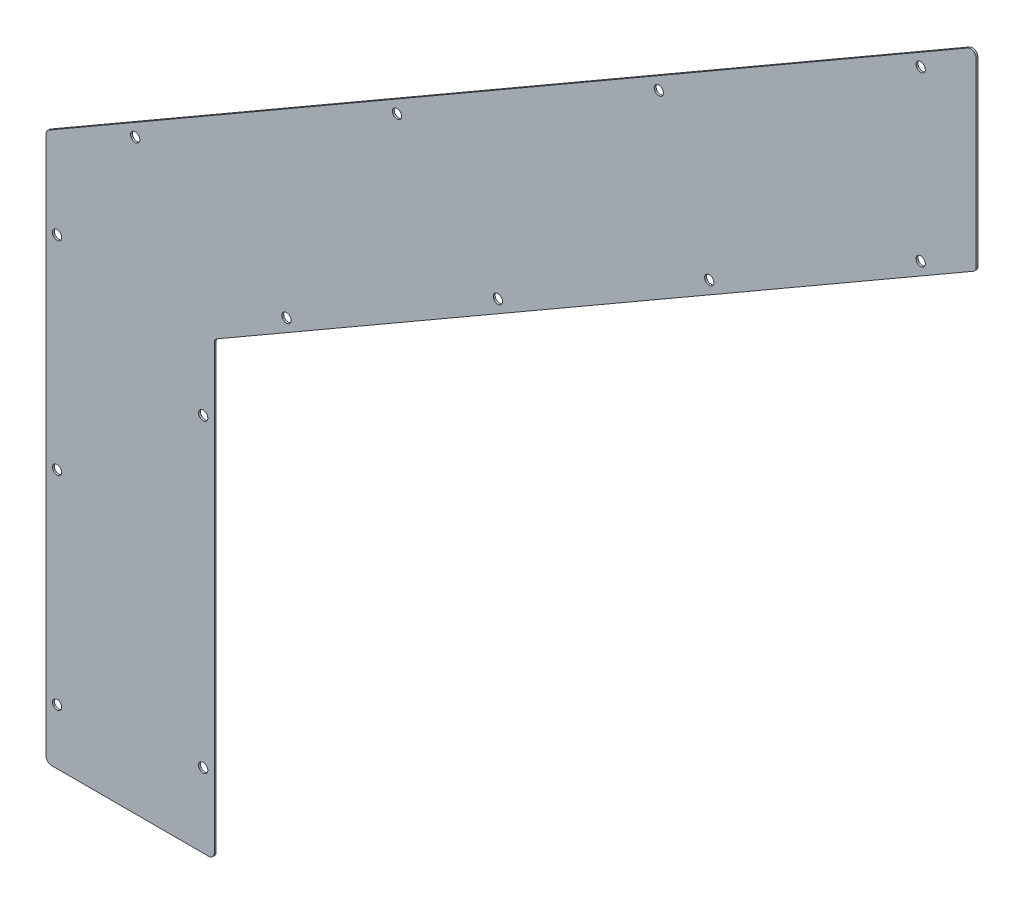
ISO-10303-21;
HEADER;
FILE_DESCRIPTION(('STEP AP214'),'2;1');
FILE_NAME('part.step','',(''),(''),'','','');
FILE_SCHEMA(('AUTOMOTIVE_DESIGN { 1 0 10303 214 1 1 1 1 }'));
ENDSEC;
DATA;
#1=APPLICATION_CONTEXT('core data for automotive mechanical design processes');
#2=APPLICATION_PROTOCOL_DEFINITION('international standard','automotive_design',2000,#1);
#3=PRODUCT_CONTEXT('',#1,'mechanical');
#4=PRODUCT('Part','Part','',(#3));
#5=PRODUCT_RELATED_PRODUCT_CATEGORY('part','',(#4));
#6=PRODUCT_DEFINITION_FORMATION('','',#4);
#7=PRODUCT_DEFINITION_CONTEXT('part definition',#1,'design');
#8=PRODUCT_DEFINITION('design','',#6,#7);
#9=PRODUCT_DEFINITION_SHAPE('','',#8);
#10=(LENGTH_UNIT() NAMED_UNIT(*) SI_UNIT(.MILLI.,.METRE.));
#11=(NAMED_UNIT(*) PLANE_ANGLE_UNIT() SI_UNIT($,.RADIAN.));
#12=(NAMED_UNIT(*) SI_UNIT($,.STERADIAN.) SOLID_ANGLE_UNIT());
#13=UNCERTAINTY_MEASURE_WITH_UNIT(LENGTH_MEASURE(1.E-05),#10,'distance_accuracy_value','');
#14=(GEOMETRIC_REPRESENTATION_CONTEXT(3) GLOBAL_UNCERTAINTY_ASSIGNED_CONTEXT((#13)) GLOBAL_UNIT_ASSIGNED_CONTEXT((#10,
#11,#12)) REPRESENTATION_CONTEXT('',''));
#15=CARTESIAN_POINT('',(0.,0.,0.));
#16=DIRECTION('',(0.,0.,1.));
#17=DIRECTION('',(1.,0.,0.));
#18=AXIS2_PLACEMENT_3D('',#15,#16,#17);
#19=CARTESIAN_POINT('',(-91.,0.,-1.));
#20=DIRECTION('',(0.,-1.,0.));
#21=DIRECTION('',(0.,0.,-1.));
#22=AXIS2_PLACEMENT_3D('',#19,#20,#21);
#23=PLANE('',#22);
#24=DIRECTION('',(1.,0.,0.));
#25=VECTOR('',#24,1.);
#26=CARTESIAN_POINT('',(-91.,0.,0.));
#27=LINE('',#26,#25);
#28=CARTESIAN_POINT('',(-88.,0.,0.));
#29=VERTEX_POINT('',#28);
#30=CARTESIAN_POINT('',(-3.,0.,0.));
#31=VERTEX_POINT('',#30);
#32=EDGE_CURVE('E241',#29,#31,#27,.T.);
#33=ORIENTED_EDGE('',*,*,#32,.F.);
#34=DIRECTION('',(0.,0.,1.));
#35=VECTOR('',#34,1.);
#36=CARTESIAN_POINT('',(-88.,0.,-1.));
#37=LINE('',#36,#35);
#38=CARTESIAN_POINT('',(-88.,0.,-1.));
#39=VERTEX_POINT('',#38);
#40=EDGE_CURVE('E187',#29,#39,#37,.F.);
#41=ORIENTED_EDGE('',*,*,#40,.T.);
#42=DIRECTION('',(1.,0.,0.));
#43=VECTOR('',#42,1.);
#44=CARTESIAN_POINT('',(-91.,0.,-1.));
#45=LINE('',#44,#43);
#46=CARTESIAN_POINT('',(-3.,0.,-1.));
#47=VERTEX_POINT('',#46);
#48=EDGE_CURVE('E274',#39,#47,#45,.T.);
#49=ORIENTED_EDGE('',*,*,#48,.T.);
#50=DIRECTION('',(0.,0.,1.));
#51=VECTOR('',#50,1.);
#52=CARTESIAN_POINT('',(-3.,0.,-1.));
#53=LINE('',#52,#51);
#54=EDGE_CURVE('E184',#47,#31,#53,.T.);
#55=ORIENTED_EDGE('',*,*,#54,.T.);
#56=EDGE_LOOP('',(#33,#41,#49,#55));
#57=FACE_BOUND('',#56,.T.);
#58=ADVANCED_FACE('F40',(#57),#23,.T.);
#59=CARTESIAN_POINT('',(-91.,296.01,-1.));
#60=DIRECTION('',(-1.,0.,0.));
#61=DIRECTION('',(0.,-1.,0.));
#62=AXIS2_PLACEMENT_3D('',#59,#60,#61);
#63=PLANE('',#62);
#64=DIRECTION('',(0.,-1.,0.));
#65=VECTOR('',#64,1.);
#66=CARTESIAN_POINT('',(-91.,296.01,0.));
#67=LINE('',#66,#65);
#68=CARTESIAN_POINT('',(-91.,294.277949192431,0.));
#69=VERTEX_POINT('',#68);
#70=CARTESIAN_POINT('',(-91.,3.,0.));
#71=VERTEX_POINT('',#70);
#72=EDGE_CURVE('E151',#69,#71,#67,.T.);
#73=ORIENTED_EDGE('',*,*,#72,.F.);
#74=DIRECTION('',(0.,0.,1.));
#75=VECTOR('',#74,1.);
#76=CARTESIAN_POINT('',(-91.,294.277949192431,-1.));
#77=LINE('',#76,#75);
#78=CARTESIAN_POINT('',(-91.,294.277949192431,-1.));
#79=VERTEX_POINT('',#78);
#80=EDGE_CURVE('E173',#69,#79,#77,.F.);
#81=ORIENTED_EDGE('',*,*,#80,.T.);
#82=DIRECTION('',(0.,-1.,0.));
#83=VECTOR('',#82,1.);
#84=CARTESIAN_POINT('',(-91.,296.01,-1.));
#85=LINE('',#84,#83);
#86=CARTESIAN_POINT('',(-91.,3.,-1.));
#87=VERTEX_POINT('',#86);
#88=EDGE_CURVE('E155',#79,#87,#85,.T.);
#89=ORIENTED_EDGE('',*,*,#88,.T.);
#90=DIRECTION('',(0.,0.,1.));
#91=VECTOR('',#90,1.);
#92=CARTESIAN_POINT('',(-91.,3.,-1.));
#93=LINE('',#92,#91);
#94=EDGE_CURVE('E170',#87,#71,#93,.T.);
#95=ORIENTED_EDGE('',*,*,#94,.T.);
#96=EDGE_LOOP('',(#73,#81,#89,#95));
#97=FACE_BOUND('',#96,.T.);
#98=ADVANCED_FACE('F293',(#97),#63,.T.);
#99=CARTESIAN_POINT('',(412.,586.41718540238,-1.));
#100=DIRECTION('',(-0.499999999999998,0.86602540378444,0.));
#101=DIRECTION('',(-0.86602540378444,-0.499999999999998,0.));
#102=AXIS2_PLACEMENT_3D('',#99,#100,#101);
#103=PLANE('',#102);
#104=DIRECTION('',(-0.86602540378444,-0.499999999999998,0.));
#105=VECTOR('',#104,1.);
#106=CARTESIAN_POINT('',(412.,586.41718540238,-1.));
#107=LINE('',#106,#105);
#108=CARTESIAN_POINT('',(407.5,583.819109191027,-1.));
#109=VERTEX_POINT('',#108);
#110=CARTESIAN_POINT('',(-89.4999999999999,296.876025403784,-1.));
#111=VERTEX_POINT('',#110);
#112=EDGE_CURVE('E159',#109,#111,#107,.T.);
#113=ORIENTED_EDGE('',*,*,#112,.T.);
#114=DIRECTION('',(0.,0.,1.));
#115=VECTOR('',#114,1.);
#116=CARTESIAN_POINT('',(-89.5,296.876025403784,-1.));
#117=LINE('',#116,#115);
#118=CARTESIAN_POINT('',(-89.4999999999999,296.876025403784,0.));
#119=VERTEX_POINT('',#118);
#120=EDGE_CURVE('E142',#111,#119,#117,.T.);
#121=ORIENTED_EDGE('',*,*,#120,.T.);
#122=DIRECTION('',(-0.86602540378444,-0.499999999999998,0.));
#123=VECTOR('',#122,1.);
#124=CARTESIAN_POINT('',(412.,586.41718540238,0.));
#125=LINE('',#124,#123);
#126=CARTESIAN_POINT('',(407.5,583.819109191027,0.));
#127=VERTEX_POINT('',#126);
#128=EDGE_CURVE('E134',#127,#119,#125,.T.);
#129=ORIENTED_EDGE('',*,*,#128,.F.);
#130=DIRECTION('',(0.,0.,1.));
#131=VECTOR('',#130,1.);
#132=CARTESIAN_POINT('',(407.5,583.819109191027,-1.));
#133=LINE('',#132,#131);
#134=EDGE_CURVE('E148',#127,#109,#133,.F.);
#135=ORIENTED_EDGE('',*,*,#134,.T.);
#136=EDGE_LOOP('',(#113,#121,#129,#135));
#137=FACE_BOUND('',#136,.T.);
#138=ADVANCED_FACE('F147',(#137),#103,.T.);
#139=CARTESIAN_POINT('',(412.,481.605017533696,-1.));
#140=DIRECTION('',(1.,0.,0.));
#141=DIRECTION('',(0.,0.,-1.));
#142=AXIS2_PLACEMENT_3D('',#139,#140,#141);
#143=PLANE('',#142);
#144=DIRECTION('',(0.,1.,0.));
#145=VECTOR('',#144,1.);
#146=CARTESIAN_POINT('',(412.,481.605017533696,0.));
#147=LINE('',#146,#145);
#148=CARTESIAN_POINT('',(412.,483.337068341265,0.));
#149=VERTEX_POINT('',#148);
#150=CARTESIAN_POINT('',(412.,581.221032979674,0.));
#151=VERTEX_POINT('',#150);
#152=EDGE_CURVE('E136',#149,#151,#147,.T.);
#153=ORIENTED_EDGE('',*,*,#152,.F.);
#154=DIRECTION('',(0.,0.,1.));
#155=VECTOR('',#154,1.);
#156=CARTESIAN_POINT('',(412.,483.337068341265,-1.));
#157=LINE('',#156,#155);
#158=CARTESIAN_POINT('',(412.,483.337068341265,-1.));
#159=VERTEX_POINT('',#158);
#160=EDGE_CURVE('E200',#149,#159,#157,.F.);
#161=ORIENTED_EDGE('',*,*,#160,.T.);
#162=DIRECTION('',(0.,1.,0.));
#163=VECTOR('',#162,1.);
#164=CARTESIAN_POINT('',(412.,481.605017533696,-1.));
#165=LINE('',#164,#163);
#166=CARTESIAN_POINT('',(412.,581.221032979674,-1.));
#167=VERTEX_POINT('',#166);
#168=EDGE_CURVE('E285',#159,#167,#165,.T.);
#169=ORIENTED_EDGE('',*,*,#168,.T.);
#170=DIRECTION('',(0.,0.,1.));
#171=VECTOR('',#170,1.);
#172=CARTESIAN_POINT('',(412.,581.221032979674,-1.));
#173=LINE('',#172,#171);
#174=EDGE_CURVE('E198',#167,#151,#173,.T.);
#175=ORIENTED_EDGE('',*,*,#174,.T.);
#176=EDGE_LOOP('',(#153,#161,#169,#175));
#177=FACE_BOUND('',#176,.T.);
#178=ADVANCED_FACE('F338',(#177),#143,.T.);
#179=CARTESIAN_POINT('',(0.,243.736706627571,-1.));
#180=DIRECTION('',(0.499999999999998,-0.86602540378444,0.));
#181=DIRECTION('',(0.86602540378444,0.499999999999998,0.));
#182=AXIS2_PLACEMENT_3D('',#179,#180,#181);
#183=PLANE('',#182);
#184=DIRECTION('',(0.86602540378444,0.499999999999998,0.));
#185=VECTOR('',#184,1.);
#186=CARTESIAN_POINT('',(0.,243.736706627571,0.));
#187=LINE('',#186,#185);
#188=CARTESIAN_POINT('',(1.50000000000001,244.602732031356,0.));
#189=VERTEX_POINT('',#188);
#190=CARTESIAN_POINT('',(410.5,480.738992129911,0.));
#191=VERTEX_POINT('',#190);
#192=EDGE_CURVE('E249',#189,#191,#187,.T.);
#193=ORIENTED_EDGE('',*,*,#192,.F.);
#194=DIRECTION('',(0.,0.,1.));
#195=VECTOR('',#194,1.);
#196=CARTESIAN_POINT('',(1.50000000000001,244.602732031356,-1.));
#197=LINE('',#196,#195);
#198=CARTESIAN_POINT('',(1.50000000000001,244.602732031356,-1.));
#199=VERTEX_POINT('',#198);
#200=EDGE_CURVE('E196',#189,#199,#197,.F.);
#201=ORIENTED_EDGE('',*,*,#200,.T.);
#202=DIRECTION('',(0.86602540378444,0.499999999999998,0.));
#203=VECTOR('',#202,1.);
#204=CARTESIAN_POINT('',(0.,243.736706627571,-1.));
#205=LINE('',#204,#203);
#206=CARTESIAN_POINT('',(410.5,480.738992129911,-1.));
#207=VERTEX_POINT('',#206);
#208=EDGE_CURVE('E277',#199,#207,#205,.T.);
#209=ORIENTED_EDGE('',*,*,#208,.T.);
#210=DIRECTION('',(0.,0.,1.));
#211=VECTOR('',#210,1.);
#212=CARTESIAN_POINT('',(410.5,480.738992129911,-1.));
#213=LINE('',#212,#211);
#214=EDGE_CURVE('E193',#207,#191,#213,.T.);
#215=ORIENTED_EDGE('',*,*,#214,.T.);
#216=EDGE_LOOP('',(#193,#201,#209,#215));
#217=FACE_BOUND('',#216,.T.);
#218=ADVANCED_FACE('F258',(#217),#183,.T.);
#219=CARTESIAN_POINT('',(0.,0.,-1.));
#220=DIRECTION('',(1.,0.,0.));
#221=DIRECTION('',(0.,0.,-1.));
#222=AXIS2_PLACEMENT_3D('',#219,#220,#221);
#223=PLANE('',#222);
#224=DIRECTION('',(0.,1.,0.));
#225=VECTOR('',#224,1.);
#226=CARTESIAN_POINT('',(0.,0.,0.));
#227=LINE('',#226,#225);
#228=CARTESIAN_POINT('',(0.,3.,0.));
#229=VERTEX_POINT('',#228);
#230=CARTESIAN_POINT('',(0.,242.004655820002,0.));
#231=VERTEX_POINT('',#230);
#232=EDGE_CURVE('E245',#229,#231,#227,.T.);
#233=ORIENTED_EDGE('',*,*,#232,.F.);
#234=DIRECTION('',(0.,0.,1.));
#235=VECTOR('',#234,1.);
#236=CARTESIAN_POINT('',(0.,3.,-1.));
#237=LINE('',#236,#235);
#238=CARTESIAN_POINT('',(0.,3.,-1.));
#239=VERTEX_POINT('',#238);
#240=EDGE_CURVE('E62',#229,#239,#237,.F.);
#241=ORIENTED_EDGE('',*,*,#240,.T.);
#242=DIRECTION('',(0.,1.,0.));
#243=VECTOR('',#242,1.);
#244=CARTESIAN_POINT('',(0.,0.,-1.));
#245=LINE('',#244,#243);
#246=CARTESIAN_POINT('',(0.,242.004655820002,-1.));
#247=VERTEX_POINT('',#246);
#248=EDGE_CURVE('E265',#239,#247,#245,.T.);
#249=ORIENTED_EDGE('',*,*,#248,.T.);
#250=DIRECTION('',(0.,0.,1.));
#251=VECTOR('',#250,1.);
#252=CARTESIAN_POINT('',(0.,242.004655820002,0.));
#253=LINE('',#252,#251);
#254=EDGE_CURVE('E189',#247,#231,#253,.T.);
#255=ORIENTED_EDGE('',*,*,#254,.T.);
#256=EDGE_LOOP('',(#233,#241,#249,#255));
#257=FACE_BOUND('',#256,.T.);
#258=ADVANCED_FACE('F264',(#257),#223,.T.);
#259=CARTESIAN_POINT('',(0.,0.,-1.));
#260=DIRECTION('',(0.,0.,1.));
#261=DIRECTION('',(1.,0.,0.));
#262=AXIS2_PLACEMENT_3D('',#259,#260,#261);
#263=PLANE('',#262);
#264=CARTESIAN_POINT('',(382.,562.168474096416,-1.));
#265=DIRECTION('',(0.,0.,-1.));
#266=DIRECTION('',(-1.,0.,0.));
#267=AXIS2_PLACEMENT_3D('',#264,#265,#266);
#268=CIRCLE('',#267,2.50000000000002);
#269=CARTESIAN_POINT('',(379.5,562.168474096416,-1.));
#270=VERTEX_POINT('',#269);
#271=EDGE_CURVE('E207',#270,#270,#268,.T.);
#272=ORIENTED_EDGE('',*,*,#271,.F.);
#273=EDGE_LOOP('',(#272));
#274=FACE_BOUND('',#273,.T.);
#275=CARTESIAN_POINT('',(-6.00000000000001,205.,-1.));
#276=DIRECTION('',(0.,0.,-1.));
#277=DIRECTION('',(-1.,0.,0.));
#278=AXIS2_PLACEMENT_3D('',#275,#276,#277);
#279=CIRCLE('',#278,2.5);
#280=CARTESIAN_POINT('',(-8.50000000000001,205.,-1.));
#281=VERTEX_POINT('',#280);
#282=EDGE_CURVE('E608',#281,#281,#279,.T.);
#283=ORIENTED_EDGE('',*,*,#282,.F.);
#284=EDGE_LOOP('',(#283));
#285=FACE_BOUND('',#284,.T.);
#286=CARTESIAN_POINT('',(-84.9999999999992,250.,-1.));
#287=DIRECTION('',(0.,0.,-1.));
#288=DIRECTION('',(-1.,0.,0.));
#289=AXIS2_PLACEMENT_3D('',#286,#287,#288);
#290=CIRCLE('',#289,2.50000000000001);
#291=CARTESIAN_POINT('',(-87.4999999999992,250.,-1.));
#292=VERTEX_POINT('',#291);
#293=EDGE_CURVE('E605',#292,#292,#290,.T.);
#294=ORIENTED_EDGE('',*,*,#293,.F.);
#295=EDGE_LOOP('',(#294));
#296=FACE_BOUND('',#295,.T.);
#297=CARTESIAN_POINT('',(-84.9999999999996,140.,-1.));
#298=DIRECTION('',(0.,0.,-1.));
#299=DIRECTION('',(-1.,0.,0.));
#300=AXIS2_PLACEMENT_3D('',#297,#298,#299);
#301=CIRCLE('',#300,2.5);
#302=CARTESIAN_POINT('',(-87.4999999999996,140.,-1.));
#303=VERTEX_POINT('',#302);
#304=EDGE_CURVE('E602',#303,#303,#301,.T.);
#305=ORIENTED_EDGE('',*,*,#304,.F.);
#306=EDGE_LOOP('',(#305));
#307=FACE_BOUND('',#306,.T.);
#308=CARTESIAN_POINT('',(-6.00000000000001,40.,-1.));
#309=DIRECTION('',(0.,0.,-1.));
#310=DIRECTION('',(-1.,0.,0.));
#311=AXIS2_PLACEMENT_3D('',#308,#309,#310);
#312=CIRCLE('',#311,2.5);
#313=CARTESIAN_POINT('',(-8.50000000000001,40.,-1.));
#314=VERTEX_POINT('',#313);
#315=EDGE_CURVE('E598',#314,#314,#312,.T.);
#316=ORIENTED_EDGE('',*,*,#315,.F.);
#317=EDGE_LOOP('',(#316));
#318=FACE_BOUND('',#317,.T.);
#319=CARTESIAN_POINT('',(382.,471.212712688284,-1.));
#320=DIRECTION('',(0.,0.,-1.));
#321=DIRECTION('',(-1.,0.,0.));
#322=AXIS2_PLACEMENT_3D('',#319,#320,#321);
#323=CIRCLE('',#322,2.50000000000002);
#324=CARTESIAN_POINT('',(379.5,471.212712688284,-1.));
#325=VERTEX_POINT('',#324);
#326=EDGE_CURVE('E592',#325,#325,#323,.T.);
#327=ORIENTED_EDGE('',*,*,#326,.F.);
#328=EDGE_LOOP('',(#327));
#329=FACE_BOUND('',#328,.T.);
#330=CARTESIAN_POINT('',(240.404846481244,480.418474096416,-1.));
#331=DIRECTION('',(0.,0.,-1.));
#332=DIRECTION('',(-1.,0.,0.));
#333=AXIS2_PLACEMENT_3D('',#330,#331,#332);
#334=CIRCLE('',#333,2.5);
#335=CARTESIAN_POINT('',(237.904846481244,480.418474096416,-1.));
#336=VERTEX_POINT('',#335);
#337=EDGE_CURVE('E595',#336,#336,#334,.T.);
#338=ORIENTED_EDGE('',*,*,#337,.F.);
#339=EDGE_LOOP('',(#338));
#340=FACE_BOUND('',#339,.T.);
#341=CARTESIAN_POINT('',(98.8096929624882,398.668474096417,-1.));
#342=DIRECTION('',(0.,0.,-1.));
#343=DIRECTION('',(-1.,0.,0.));
#344=AXIS2_PLACEMENT_3D('',#341,#342,#343);
#345=CIRCLE('',#344,2.5);
#346=CARTESIAN_POINT('',(96.3096929624882,398.668474096417,-1.));
#347=VERTEX_POINT('',#346);
#348=EDGE_CURVE('E623',#347,#347,#345,.T.);
#349=ORIENTED_EDGE('',*,*,#348,.F.);
#350=EDGE_LOOP('',(#349));
#351=FACE_BOUND('',#350,.T.);
#352=CARTESIAN_POINT('',(-42.7854605562677,316.918474096417,-1.));
#353=DIRECTION('',(0.,0.,-1.));
#354=DIRECTION('',(-1.,0.,0.));
#355=AXIS2_PLACEMENT_3D('',#352,#353,#354);
#356=CIRCLE('',#355,2.5);
#357=CARTESIAN_POINT('',(-45.2854605562677,316.918474096417,-1.));
#358=VERTEX_POINT('',#357);
#359=EDGE_CURVE('E281',#358,#358,#356,.T.);
#360=ORIENTED_EDGE('',*,*,#359,.F.);
#361=EDGE_LOOP('',(#360));
#362=FACE_BOUND('',#361,.T.);
#363=CARTESIAN_POINT('',(39.0539401013619,273.212712688285,-1.));
#364=DIRECTION('',(0.,0.,-1.));
#365=DIRECTION('',(-1.,0.,0.));
#366=AXIS2_PLACEMENT_3D('',#363,#364,#365);
#367=CIRCLE('',#366,2.5);
#368=CARTESIAN_POINT('',(36.5539401013619,273.212712688285,-1.));
#369=VERTEX_POINT('',#368);
#370=EDGE_CURVE('E601',#369,#369,#367,.T.);
#371=ORIENTED_EDGE('',*,*,#370,.F.);
#372=EDGE_LOOP('',(#371));
#373=FACE_BOUND('',#372,.T.);
#374=CARTESIAN_POINT('',(153.369293400908,339.212712688284,-1.));
#375=DIRECTION('',(0.,0.,-1.));
#376=DIRECTION('',(-1.,0.,0.));
#377=AXIS2_PLACEMENT_3D('',#374,#375,#376);
#378=CIRCLE('',#377,2.5);
#379=CARTESIAN_POINT('',(150.869293400908,339.212712688284,-1.));
#380=VERTEX_POINT('',#379);
#381=EDGE_CURVE('E611',#380,#380,#378,.T.);
#382=ORIENTED_EDGE('',*,*,#381,.F.);
#383=EDGE_LOOP('',(#382));
#384=FACE_BOUND('',#383,.T.);
#385=CARTESIAN_POINT('',(267.684646700454,405.212712688284,-1.));
#386=DIRECTION('',(0.,0.,-1.));
#387=DIRECTION('',(-1.,0.,0.));
#388=AXIS2_PLACEMENT_3D('',#385,#386,#387);
#389=CIRCLE('',#388,2.50000000000002);
#390=CARTESIAN_POINT('',(265.184646700454,405.212712688284,-1.));
#391=VERTEX_POINT('',#390);
#392=EDGE_CURVE('E614',#391,#391,#389,.T.);
#393=ORIENTED_EDGE('',*,*,#392,.F.);
#394=EDGE_LOOP('',(#393));
#395=FACE_BOUND('',#394,.T.);
#396=CARTESIAN_POINT('',(-85.,30.,-1.));
#397=DIRECTION('',(0.,0.,-1.));
#398=DIRECTION('',(-1.,0.,0.));
#399=AXIS2_PLACEMENT_3D('',#396,#397,#398);
#400=CIRCLE('',#399,2.5);
#401=CARTESIAN_POINT('',(-87.5,30.,-1.));
#402=VERTEX_POINT('',#401);
#403=EDGE_CURVE('E617',#402,#402,#400,.T.);
#404=ORIENTED_EDGE('',*,*,#403,.F.);
#405=EDGE_LOOP('',(#404));
#406=FACE_BOUND('',#405,.T.);
#407=ORIENTED_EDGE('',*,*,#88,.F.);
#408=CARTESIAN_POINT('',(-88.,294.277949192431,-1.));
#409=DIRECTION('',(0.,0.,1.));
#410=DIRECTION('',(1.,0.,0.));
#411=AXIS2_PLACEMENT_3D('',#408,#409,#410);
#412=CIRCLE('',#411,3.);
#413=EDGE_CURVE('E182',#79,#111,#412,.F.);
#414=ORIENTED_EDGE('',*,*,#413,.T.);
#415=ORIENTED_EDGE('',*,*,#112,.F.);
#416=CARTESIAN_POINT('',(409.,581.221032979674,-1.));
#417=DIRECTION('',(0.,0.,1.));
#418=DIRECTION('',(1.,0.,0.));
#419=AXIS2_PLACEMENT_3D('',#416,#417,#418);
#420=CIRCLE('',#419,3.);
#421=EDGE_CURVE('E154',#109,#167,#420,.F.);
#422=ORIENTED_EDGE('',*,*,#421,.T.);
#423=ORIENTED_EDGE('',*,*,#168,.F.);
#424=CARTESIAN_POINT('',(409.,483.337068341265,-1.));
#425=DIRECTION('',(0.,0.,1.));
#426=DIRECTION('',(1.,0.,0.));
#427=AXIS2_PLACEMENT_3D('',#424,#425,#426);
#428=CIRCLE('',#427,3.);
#429=EDGE_CURVE('E176',#159,#207,#428,.F.);
#430=ORIENTED_EDGE('',*,*,#429,.T.);
#431=ORIENTED_EDGE('',*,*,#208,.F.);
#432=CARTESIAN_POINT('',(3.,242.004655820002,-1.));
#433=DIRECTION('',(0.,0.,1.));
#434=DIRECTION('',(1.,0.,0.));
#435=AXIS2_PLACEMENT_3D('',#432,#433,#434);
#436=CIRCLE('',#435,3.);
#437=EDGE_CURVE('E11',#199,#247,#436,.T.);
#438=ORIENTED_EDGE('',*,*,#437,.T.);
#439=ORIENTED_EDGE('',*,*,#248,.F.);
#440=CARTESIAN_POINT('',(-3.,3.,-1.));
#441=DIRECTION('',(0.,0.,1.));
#442=DIRECTION('',(1.,0.,0.));
#443=AXIS2_PLACEMENT_3D('',#440,#441,#442);
#444=CIRCLE('',#443,3.);
#445=EDGE_CURVE('E178',#239,#47,#444,.F.);
#446=ORIENTED_EDGE('',*,*,#445,.T.);
#447=ORIENTED_EDGE('',*,*,#48,.F.);
#448=CARTESIAN_POINT('',(-88.,3.,-1.));
#449=DIRECTION('',(0.,0.,1.));
#450=DIRECTION('',(1.,0.,0.));
#451=AXIS2_PLACEMENT_3D('',#448,#449,#450);
#452=CIRCLE('',#451,3.);
#453=EDGE_CURVE('E180',#39,#87,#452,.F.);
#454=ORIENTED_EDGE('',*,*,#453,.T.);
#455=EDGE_LOOP('',(#407,#414,#415,#422,#423,#430,#431,#438,#439,#446,#447,#454));
#456=FACE_BOUND('',#455,.T.);
#457=ADVANCED_FACE('F298',(#274,#285,#296,#307,#318,#329,#340,#351,#362,#373,#384,#395,#406,
#456),#263,.F.);
#458=CARTESIAN_POINT('',(0.,0.,0.));
#459=DIRECTION('',(0.,0.,1.));
#460=DIRECTION('',(1.,0.,0.));
#461=AXIS2_PLACEMENT_3D('',#458,#459,#460);
#462=PLANE('',#461);
#463=CARTESIAN_POINT('',(382.,562.168474096416,0.));
#464=DIRECTION('',(0.,0.,1.));
#465=DIRECTION('',(1.,0.,0.));
#466=AXIS2_PLACEMENT_3D('',#463,#464,#465);
#467=CIRCLE('',#466,2.50000000000002);
#468=CARTESIAN_POINT('',(384.5,562.168474096416,0.));
#469=VERTEX_POINT('',#468);
#470=EDGE_CURVE('E44',#469,#469,#467,.T.);
#471=ORIENTED_EDGE('',*,*,#470,.F.);
#472=EDGE_LOOP('',(#471));
#473=FACE_BOUND('',#472,.T.);
#474=CARTESIAN_POINT('',(-6.00000000000001,205.,0.));
#475=DIRECTION('',(0.,0.,1.));
#476=DIRECTION('',(1.,0.,0.));
#477=AXIS2_PLACEMENT_3D('',#474,#475,#476);
#478=CIRCLE('',#477,2.5);
#479=CARTESIAN_POINT('',(-3.5,205.,0.));
#480=VERTEX_POINT('',#479);
#481=EDGE_CURVE('E236',#480,#480,#478,.T.);
#482=ORIENTED_EDGE('',*,*,#481,.F.);
#483=EDGE_LOOP('',(#482));
#484=FACE_BOUND('',#483,.T.);
#485=CARTESIAN_POINT('',(-84.9999999999992,250.,0.));
#486=DIRECTION('',(0.,0.,1.));
#487=DIRECTION('',(1.,0.,0.));
#488=AXIS2_PLACEMENT_3D('',#485,#486,#487);
#489=CIRCLE('',#488,2.50000000000001);
#490=CARTESIAN_POINT('',(-82.4999999999992,250.,0.));
#491=VERTEX_POINT('',#490);
#492=EDGE_CURVE('E234',#491,#491,#489,.T.);
#493=ORIENTED_EDGE('',*,*,#492,.F.);
#494=EDGE_LOOP('',(#493));
#495=FACE_BOUND('',#494,.T.);
#496=CARTESIAN_POINT('',(-84.9999999999996,140.,0.));
#497=DIRECTION('',(0.,0.,1.));
#498=DIRECTION('',(1.,0.,0.));
#499=AXIS2_PLACEMENT_3D('',#496,#497,#498);
#500=CIRCLE('',#499,2.5);
#501=CARTESIAN_POINT('',(-82.4999999999996,140.,0.));
#502=VERTEX_POINT('',#501);
#503=EDGE_CURVE('E231',#502,#502,#500,.T.);
#504=ORIENTED_EDGE('',*,*,#503,.F.);
#505=EDGE_LOOP('',(#504));
#506=FACE_BOUND('',#505,.T.);
#507=CARTESIAN_POINT('',(-6.00000000000001,40.,0.));
#508=DIRECTION('',(0.,0.,1.));
#509=DIRECTION('',(1.,0.,0.));
#510=AXIS2_PLACEMENT_3D('',#507,#508,#509);
#511=CIRCLE('',#510,2.5);
#512=CARTESIAN_POINT('',(-3.5,40.,0.));
#513=VERTEX_POINT('',#512);
#514=EDGE_CURVE('E228',#513,#513,#511,.T.);
#515=ORIENTED_EDGE('',*,*,#514,.F.);
#516=EDGE_LOOP('',(#515));
#517=FACE_BOUND('',#516,.T.);
#518=CARTESIAN_POINT('',(382.,471.212712688284,0.));
#519=DIRECTION('',(0.,0.,1.));
#520=DIRECTION('',(1.,0.,0.));
#521=AXIS2_PLACEMENT_3D('',#518,#519,#520);
#522=CIRCLE('',#521,2.50000000000002);
#523=CARTESIAN_POINT('',(384.5,471.212712688284,0.));
#524=VERTEX_POINT('',#523);
#525=EDGE_CURVE('E225',#524,#524,#522,.T.);
#526=ORIENTED_EDGE('',*,*,#525,.F.);
#527=EDGE_LOOP('',(#526));
#528=FACE_BOUND('',#527,.T.);
#529=CARTESIAN_POINT('',(240.404846481244,480.418474096416,0.));
#530=DIRECTION('',(0.,0.,1.));
#531=DIRECTION('',(1.,0.,0.));
#532=AXIS2_PLACEMENT_3D('',#529,#530,#531);
#533=CIRCLE('',#532,2.5);
#534=CARTESIAN_POINT('',(242.904846481244,480.418474096416,0.));
#535=VERTEX_POINT('',#534);
#536=EDGE_CURVE('E222',#535,#535,#533,.T.);
#537=ORIENTED_EDGE('',*,*,#536,.F.);
#538=EDGE_LOOP('',(#537));
#539=FACE_BOUND('',#538,.T.);
#540=CARTESIAN_POINT('',(98.8096929624882,398.668474096417,0.));
#541=DIRECTION('',(0.,0.,1.));
#542=DIRECTION('',(1.,0.,0.));
#543=AXIS2_PLACEMENT_3D('',#540,#541,#542);
#544=CIRCLE('',#543,2.5);
#545=CARTESIAN_POINT('',(101.309692962488,398.668474096417,0.));
#546=VERTEX_POINT('',#545);
#547=EDGE_CURVE('E219',#546,#546,#544,.T.);
#548=ORIENTED_EDGE('',*,*,#547,.F.);
#549=EDGE_LOOP('',(#548));
#550=FACE_BOUND('',#549,.T.);
#551=CARTESIAN_POINT('',(-42.7854605562677,316.918474096417,0.));
#552=DIRECTION('',(0.,0.,1.));
#553=DIRECTION('',(1.,0.,0.));
#554=AXIS2_PLACEMENT_3D('',#551,#552,#553);
#555=CIRCLE('',#554,2.5);
#556=CARTESIAN_POINT('',(-40.2854605562677,316.918474096417,0.));
#557=VERTEX_POINT('',#556);
#558=EDGE_CURVE('E216',#557,#557,#555,.T.);
#559=ORIENTED_EDGE('',*,*,#558,.F.);
#560=EDGE_LOOP('',(#559));
#561=FACE_BOUND('',#560,.T.);
#562=CARTESIAN_POINT('',(39.0539401013619,273.212712688285,0.));
#563=DIRECTION('',(0.,0.,1.));
#564=DIRECTION('',(1.,0.,0.));
#565=AXIS2_PLACEMENT_3D('',#562,#563,#564);
#566=CIRCLE('',#565,2.5);
#567=CARTESIAN_POINT('',(41.5539401013619,273.212712688285,0.));
#568=VERTEX_POINT('',#567);
#569=EDGE_CURVE('E213',#568,#568,#566,.T.);
#570=ORIENTED_EDGE('',*,*,#569,.F.);
#571=EDGE_LOOP('',(#570));
#572=FACE_BOUND('',#571,.T.);
#573=CARTESIAN_POINT('',(153.369293400908,339.212712688284,0.));
#574=DIRECTION('',(0.,0.,1.));
#575=DIRECTION('',(1.,0.,0.));
#576=AXIS2_PLACEMENT_3D('',#573,#574,#575);
#577=CIRCLE('',#576,2.5);
#578=CARTESIAN_POINT('',(155.869293400908,339.212712688284,0.));
#579=VERTEX_POINT('',#578);
#580=EDGE_CURVE('E210',#579,#579,#577,.T.);
#581=ORIENTED_EDGE('',*,*,#580,.F.);
#582=EDGE_LOOP('',(#581));
#583=FACE_BOUND('',#582,.T.);
#584=CARTESIAN_POINT('',(267.684646700454,405.212712688284,0.));
#585=DIRECTION('',(0.,0.,1.));
#586=DIRECTION('',(1.,0.,0.));
#587=AXIS2_PLACEMENT_3D('',#584,#585,#586);
#588=CIRCLE('',#587,2.50000000000002);
#589=CARTESIAN_POINT('',(270.184646700454,405.212712688284,0.));
#590=VERTEX_POINT('',#589);
#591=EDGE_CURVE('E206',#590,#590,#588,.T.);
#592=ORIENTED_EDGE('',*,*,#591,.F.);
#593=EDGE_LOOP('',(#592));
#594=FACE_BOUND('',#593,.T.);
#595=CARTESIAN_POINT('',(-85.,30.,0.));
#596=DIRECTION('',(0.,0.,1.));
#597=DIRECTION('',(1.,0.,0.));
#598=AXIS2_PLACEMENT_3D('',#595,#596,#597);
#599=CIRCLE('',#598,2.5);
#600=CARTESIAN_POINT('',(-82.5,30.,0.));
#601=VERTEX_POINT('',#600);
#602=EDGE_CURVE('E203',#601,#601,#599,.T.);
#603=ORIENTED_EDGE('',*,*,#602,.F.);
#604=EDGE_LOOP('',(#603));
#605=FACE_BOUND('',#604,.T.);
#606=ORIENTED_EDGE('',*,*,#128,.T.);
#607=CARTESIAN_POINT('',(-88.,294.277949192431,0.));
#608=DIRECTION('',(0.,0.,1.));
#609=DIRECTION('',(1.,0.,0.));
#610=AXIS2_PLACEMENT_3D('',#607,#608,#609);
#611=CIRCLE('',#610,3.);
#612=EDGE_CURVE('E168',#119,#69,#611,.T.);
#613=ORIENTED_EDGE('',*,*,#612,.T.);
#614=ORIENTED_EDGE('',*,*,#72,.T.);
#615=CARTESIAN_POINT('',(-88.,3.,0.));
#616=DIRECTION('',(0.,0.,1.));
#617=DIRECTION('',(1.,0.,0.));
#618=AXIS2_PLACEMENT_3D('',#615,#616,#617);
#619=CIRCLE('',#618,3.);
#620=EDGE_CURVE('E166',#71,#29,#619,.T.);
#621=ORIENTED_EDGE('',*,*,#620,.T.);
#622=ORIENTED_EDGE('',*,*,#32,.T.);
#623=CARTESIAN_POINT('',(-3.,3.,0.));
#624=DIRECTION('',(0.,0.,1.));
#625=DIRECTION('',(1.,0.,0.));
#626=AXIS2_PLACEMENT_3D('',#623,#624,#625);
#627=CIRCLE('',#626,3.);
#628=EDGE_CURVE('E164',#31,#229,#627,.T.);
#629=ORIENTED_EDGE('',*,*,#628,.T.);
#630=ORIENTED_EDGE('',*,*,#232,.T.);
#631=CARTESIAN_POINT('',(3.,242.004655820002,0.));
#632=DIRECTION('',(0.,0.,1.));
#633=DIRECTION('',(1.,0.,0.));
#634=AXIS2_PLACEMENT_3D('',#631,#632,#633);
#635=CIRCLE('',#634,3.);
#636=EDGE_CURVE('E49',#231,#189,#635,.F.);
#637=ORIENTED_EDGE('',*,*,#636,.T.);
#638=ORIENTED_EDGE('',*,*,#192,.T.);
#639=CARTESIAN_POINT('',(409.,483.337068341265,0.));
#640=DIRECTION('',(0.,0.,1.));
#641=DIRECTION('',(1.,0.,0.));
#642=AXIS2_PLACEMENT_3D('',#639,#640,#641);
#643=CIRCLE('',#642,3.);
#644=EDGE_CURVE('E141',#191,#149,#643,.T.);
#645=ORIENTED_EDGE('',*,*,#644,.T.);
#646=ORIENTED_EDGE('',*,*,#152,.T.);
#647=CARTESIAN_POINT('',(409.,581.221032979674,0.));
#648=DIRECTION('',(0.,0.,1.));
#649=DIRECTION('',(1.,0.,0.));
#650=AXIS2_PLACEMENT_3D('',#647,#648,#649);
#651=CIRCLE('',#650,3.);
#652=EDGE_CURVE('E131',#151,#127,#651,.T.);
#653=ORIENTED_EDGE('',*,*,#652,.T.);
#654=EDGE_LOOP('',(#606,#613,#614,#621,#622,#629,#630,#637,#638,#645,#646,#653));
#655=FACE_BOUND('',#654,.T.);
#656=ADVANCED_FACE('F133',(#473,#484,#495,#506,#517,#528,#539,#550,#561,#572,#583,#594,#605,
#655),#462,.T.);
#657=CARTESIAN_POINT('',(-88.,294.277949192431,-1.));
#658=DIRECTION('',(0.,0.,1.));
#659=DIRECTION('',(1.,0.,0.));
#660=AXIS2_PLACEMENT_3D('',#657,#658,#659);
#661=CYLINDRICAL_SURFACE('',#660,3.);
#662=ORIENTED_EDGE('',*,*,#413,.F.);
#663=ORIENTED_EDGE('',*,*,#80,.F.);
#664=ORIENTED_EDGE('',*,*,#612,.F.);
#665=ORIENTED_EDGE('',*,*,#120,.F.);
#666=EDGE_LOOP('',(#662,#663,#664,#665));
#667=FACE_BOUND('',#666,.T.);
#668=ADVANCED_FACE('F289',(#667),#661,.T.);
#669=CARTESIAN_POINT('',(-88.,3.,-1.));
#670=DIRECTION('',(0.,0.,1.));
#671=DIRECTION('',(1.,0.,0.));
#672=AXIS2_PLACEMENT_3D('',#669,#670,#671);
#673=CYLINDRICAL_SURFACE('',#672,3.);
#674=ORIENTED_EDGE('',*,*,#453,.F.);
#675=ORIENTED_EDGE('',*,*,#40,.F.);
#676=ORIENTED_EDGE('',*,*,#620,.F.);
#677=ORIENTED_EDGE('',*,*,#94,.F.);
#678=EDGE_LOOP('',(#674,#675,#676,#677));
#679=FACE_BOUND('',#678,.T.);
#680=ADVANCED_FACE('F297',(#679),#673,.T.);
#681=CARTESIAN_POINT('',(-3.,3.,-1.));
#682=DIRECTION('',(0.,0.,1.));
#683=DIRECTION('',(1.,0.,0.));
#684=AXIS2_PLACEMENT_3D('',#681,#682,#683);
#685=CYLINDRICAL_SURFACE('',#684,3.);
#686=ORIENTED_EDGE('',*,*,#445,.F.);
#687=ORIENTED_EDGE('',*,*,#240,.F.);
#688=ORIENTED_EDGE('',*,*,#628,.F.);
#689=ORIENTED_EDGE('',*,*,#54,.F.);
#690=EDGE_LOOP('',(#686,#687,#688,#689));
#691=FACE_BOUND('',#690,.T.);
#692=ADVANCED_FACE('F269',(#691),#685,.T.);
#693=CARTESIAN_POINT('',(3.,242.004655820002,-1.));
#694=DIRECTION('',(0.,0.,-1.));
#695=DIRECTION('',(-1.,0.,0.));
#696=AXIS2_PLACEMENT_3D('',#693,#694,#695);
#697=CYLINDRICAL_SURFACE('',#696,3.);
#698=ORIENTED_EDGE('',*,*,#437,.F.);
#699=ORIENTED_EDGE('',*,*,#200,.F.);
#700=ORIENTED_EDGE('',*,*,#636,.F.);
#701=ORIENTED_EDGE('',*,*,#254,.F.);
#702=EDGE_LOOP('',(#698,#699,#700,#701));
#703=FACE_BOUND('',#702,.T.);
#704=ADVANCED_FACE('F262',(#703),#697,.F.);
#705=CARTESIAN_POINT('',(409.,483.337068341265,-1.));
#706=DIRECTION('',(0.,0.,1.));
#707=DIRECTION('',(1.,0.,0.));
#708=AXIS2_PLACEMENT_3D('',#705,#706,#707);
#709=CYLINDRICAL_SURFACE('',#708,3.);
#710=ORIENTED_EDGE('',*,*,#429,.F.);
#711=ORIENTED_EDGE('',*,*,#160,.F.);
#712=ORIENTED_EDGE('',*,*,#644,.F.);
#713=ORIENTED_EDGE('',*,*,#214,.F.);
#714=EDGE_LOOP('',(#710,#711,#712,#713));
#715=FACE_BOUND('',#714,.T.);
#716=ADVANCED_FACE('F327',(#715),#709,.T.);
#717=CARTESIAN_POINT('',(409.,581.221032979674,-1.));
#718=DIRECTION('',(0.,0.,1.));
#719=DIRECTION('',(1.,0.,0.));
#720=AXIS2_PLACEMENT_3D('',#717,#718,#719);
#721=CYLINDRICAL_SURFACE('',#720,3.);
#722=ORIENTED_EDGE('',*,*,#421,.F.);
#723=ORIENTED_EDGE('',*,*,#134,.F.);
#724=ORIENTED_EDGE('',*,*,#652,.F.);
#725=ORIENTED_EDGE('',*,*,#174,.F.);
#726=EDGE_LOOP('',(#722,#723,#724,#725));
#727=FACE_BOUND('',#726,.T.);
#728=ADVANCED_FACE('F42',(#727),#721,.T.);
#729=CARTESIAN_POINT('',(-85.,30.,9.));
#730=DIRECTION('',(0.,0.,-1.));
#731=DIRECTION('',(-1.,0.,0.));
#732=AXIS2_PLACEMENT_3D('',#729,#730,#731);
#733=CYLINDRICAL_SURFACE('',#732,2.5);
#734=ORIENTED_EDGE('',*,*,#602,.T.);
#735=EDGE_LOOP('',(#734));
#736=FACE_BOUND('',#735,.T.);
#737=ORIENTED_EDGE('',*,*,#403,.T.);
#738=EDGE_LOOP('',(#737));
#739=FACE_BOUND('',#738,.T.);
#740=ADVANCED_FACE('F333',(#736,#739),#733,.F.);
#741=CARTESIAN_POINT('',(267.684646700454,405.212712688284,9.));
#742=DIRECTION('',(0.,0.,-1.));
#743=DIRECTION('',(-1.,0.,0.));
#744=AXIS2_PLACEMENT_3D('',#741,#742,#743);
#745=CYLINDRICAL_SURFACE('',#744,2.50000000000002);
#746=ORIENTED_EDGE('',*,*,#591,.T.);
#747=EDGE_LOOP('',(#746));
#748=FACE_BOUND('',#747,.T.);
#749=ORIENTED_EDGE('',*,*,#392,.T.);
#750=EDGE_LOOP('',(#749));
#751=FACE_BOUND('',#750,.T.);
#752=ADVANCED_FACE('F402',(#748,#751),#745,.F.);
#753=CARTESIAN_POINT('',(153.369293400908,339.212712688284,9.));
#754=DIRECTION('',(0.,0.,-1.));
#755=DIRECTION('',(-1.,0.,0.));
#756=AXIS2_PLACEMENT_3D('',#753,#754,#755);
#757=CYLINDRICAL_SURFACE('',#756,2.5);
#758=ORIENTED_EDGE('',*,*,#580,.T.);
#759=EDGE_LOOP('',(#758));
#760=FACE_BOUND('',#759,.T.);
#761=ORIENTED_EDGE('',*,*,#381,.T.);
#762=EDGE_LOOP('',(#761));
#763=FACE_BOUND('',#762,.T.);
#764=ADVANCED_FACE('F413',(#760,#763),#757,.F.);
#765=CARTESIAN_POINT('',(39.0539401013619,273.212712688285,9.));
#766=DIRECTION('',(0.,0.,-1.));
#767=DIRECTION('',(-1.,0.,0.));
#768=AXIS2_PLACEMENT_3D('',#765,#766,#767);
#769=CYLINDRICAL_SURFACE('',#768,2.5);
#770=ORIENTED_EDGE('',*,*,#569,.T.);
#771=EDGE_LOOP('',(#770));
#772=FACE_BOUND('',#771,.T.);
#773=ORIENTED_EDGE('',*,*,#370,.T.);
#774=EDGE_LOOP('',(#773));
#775=FACE_BOUND('',#774,.T.);
#776=ADVANCED_FACE('F423',(#772,#775),#769,.F.);
#777=CARTESIAN_POINT('',(-42.7854605562677,316.918474096417,9.));
#778=DIRECTION('',(0.,0.,-1.));
#779=DIRECTION('',(-1.,0.,0.));
#780=AXIS2_PLACEMENT_3D('',#777,#778,#779);
#781=CYLINDRICAL_SURFACE('',#780,2.5);
#782=ORIENTED_EDGE('',*,*,#558,.T.);
#783=EDGE_LOOP('',(#782));
#784=FACE_BOUND('',#783,.T.);
#785=ORIENTED_EDGE('',*,*,#359,.T.);
#786=EDGE_LOOP('',(#785));
#787=FACE_BOUND('',#786,.T.);
#788=ADVANCED_FACE('F433',(#784,#787),#781,.F.);
#789=CARTESIAN_POINT('',(98.8096929624882,398.668474096417,9.));
#790=DIRECTION('',(0.,0.,-1.));
#791=DIRECTION('',(-1.,0.,0.));
#792=AXIS2_PLACEMENT_3D('',#789,#790,#791);
#793=CYLINDRICAL_SURFACE('',#792,2.5);
#794=ORIENTED_EDGE('',*,*,#547,.T.);
#795=EDGE_LOOP('',(#794));
#796=FACE_BOUND('',#795,.T.);
#797=ORIENTED_EDGE('',*,*,#348,.T.);
#798=EDGE_LOOP('',(#797));
#799=FACE_BOUND('',#798,.T.);
#800=ADVANCED_FACE('F443',(#796,#799),#793,.F.);
#801=CARTESIAN_POINT('',(240.404846481244,480.418474096416,9.));
#802=DIRECTION('',(0.,0.,-1.));
#803=DIRECTION('',(-1.,0.,0.));
#804=AXIS2_PLACEMENT_3D('',#801,#802,#803);
#805=CYLINDRICAL_SURFACE('',#804,2.5);
#806=ORIENTED_EDGE('',*,*,#536,.T.);
#807=EDGE_LOOP('',(#806));
#808=FACE_BOUND('',#807,.T.);
#809=ORIENTED_EDGE('',*,*,#337,.T.);
#810=EDGE_LOOP('',(#809));
#811=FACE_BOUND('',#810,.T.);
#812=ADVANCED_FACE('F452',(#808,#811),#805,.F.);
#813=CARTESIAN_POINT('',(382.,471.212712688284,9.));
#814=DIRECTION('',(0.,0.,-1.));
#815=DIRECTION('',(-1.,0.,0.));
#816=AXIS2_PLACEMENT_3D('',#813,#814,#815);
#817=CYLINDRICAL_SURFACE('',#816,2.50000000000002);
#818=ORIENTED_EDGE('',*,*,#525,.T.);
#819=EDGE_LOOP('',(#818));
#820=FACE_BOUND('',#819,.T.);
#821=ORIENTED_EDGE('',*,*,#326,.T.);
#822=EDGE_LOOP('',(#821));
#823=FACE_BOUND('',#822,.T.);
#824=ADVANCED_FACE('F462',(#820,#823),#817,.F.);
#825=CARTESIAN_POINT('',(-6.00000000000001,40.,9.));
#826=DIRECTION('',(0.,0.,-1.));
#827=DIRECTION('',(-1.,0.,0.));
#828=AXIS2_PLACEMENT_3D('',#825,#826,#827);
#829=CYLINDRICAL_SURFACE('',#828,2.5);
#830=ORIENTED_EDGE('',*,*,#514,.T.);
#831=EDGE_LOOP('',(#830));
#832=FACE_BOUND('',#831,.T.);
#833=ORIENTED_EDGE('',*,*,#315,.T.);
#834=EDGE_LOOP('',(#833));
#835=FACE_BOUND('',#834,.T.);
#836=ADVANCED_FACE('F472',(#832,#835),#829,.F.);
#837=CARTESIAN_POINT('',(-84.9999999999996,140.,9.));
#838=DIRECTION('',(0.,0.,-1.));
#839=DIRECTION('',(-1.,0.,0.));
#840=AXIS2_PLACEMENT_3D('',#837,#838,#839);
#841=CYLINDRICAL_SURFACE('',#840,2.5);
#842=ORIENTED_EDGE('',*,*,#503,.T.);
#843=EDGE_LOOP('',(#842));
#844=FACE_BOUND('',#843,.T.);
#845=ORIENTED_EDGE('',*,*,#304,.T.);
#846=EDGE_LOOP('',(#845));
#847=FACE_BOUND('',#846,.T.);
#848=ADVANCED_FACE('F482',(#844,#847),#841,.F.);
#849=CARTESIAN_POINT('',(-84.9999999999992,250.,9.));
#850=DIRECTION('',(0.,0.,-1.));
#851=DIRECTION('',(-1.,0.,0.));
#852=AXIS2_PLACEMENT_3D('',#849,#850,#851);
#853=CYLINDRICAL_SURFACE('',#852,2.50000000000001);
#854=ORIENTED_EDGE('',*,*,#492,.T.);
#855=EDGE_LOOP('',(#854));
#856=FACE_BOUND('',#855,.T.);
#857=ORIENTED_EDGE('',*,*,#293,.T.);
#858=EDGE_LOOP('',(#857));
#859=FACE_BOUND('',#858,.T.);
#860=ADVANCED_FACE('F492',(#856,#859),#853,.F.);
#861=CARTESIAN_POINT('',(-6.00000000000001,205.,9.));
#862=DIRECTION('',(0.,0.,-1.));
#863=DIRECTION('',(-1.,0.,0.));
#864=AXIS2_PLACEMENT_3D('',#861,#862,#863);
#865=CYLINDRICAL_SURFACE('',#864,2.5);
#866=ORIENTED_EDGE('',*,*,#481,.T.);
#867=EDGE_LOOP('',(#866));
#868=FACE_BOUND('',#867,.T.);
#869=ORIENTED_EDGE('',*,*,#282,.T.);
#870=EDGE_LOOP('',(#869));
#871=FACE_BOUND('',#870,.T.);
#872=ADVANCED_FACE('F502',(#868,#871),#865,.F.);
#873=CARTESIAN_POINT('',(382.,562.168474096416,9.));
#874=DIRECTION('',(0.,0.,-1.));
#875=DIRECTION('',(-1.,0.,0.));
#876=AXIS2_PLACEMENT_3D('',#873,#874,#875);
#877=CYLINDRICAL_SURFACE('',#876,2.50000000000002);
#878=ORIENTED_EDGE('',*,*,#470,.T.);
#879=EDGE_LOOP('',(#878));
#880=FACE_BOUND('',#879,.T.);
#881=ORIENTED_EDGE('',*,*,#271,.T.);
#882=EDGE_LOOP('',(#881));
#883=FACE_BOUND('',#882,.T.);
#884=ADVANCED_FACE('F512',(#880,#883),#877,.F.);
#885=CLOSED_SHELL('',(#58,#98,#138,#178,#218,#258,#457,#656,#668,#680,#692,#704,#716,#728,#740,
#752,#764,#776,#788,#800,#812,#824,#836,#848,#860,#872,#884));
#886=MANIFOLD_SOLID_BREP('B2',#885);
#887=ADVANCED_BREP_SHAPE_REPRESENTATION('',(#18,#886),#14);
#888=SHAPE_DEFINITION_REPRESENTATION(#9,#887);
ENDSEC;
END-ISO-10303-21;
